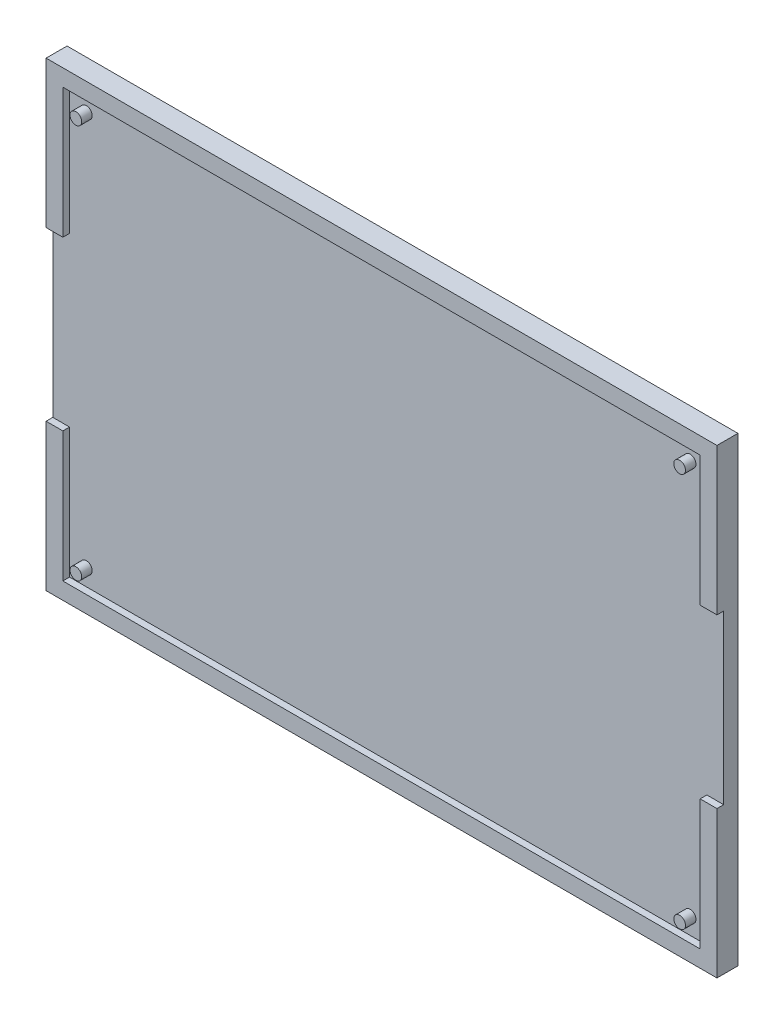
ISO-10303-21;
HEADER;
FILE_DESCRIPTION(('STEP AP214'),'2;1');
FILE_NAME('part.step','',(''),(''),'','','');
FILE_SCHEMA(('AUTOMOTIVE_DESIGN { 1 0 10303 214 1 1 1 1 }'));
ENDSEC;
DATA;
#1=APPLICATION_CONTEXT('core data for automotive mechanical design processes');
#2=APPLICATION_PROTOCOL_DEFINITION('international standard','automotive_design',2000,#1);
#3=PRODUCT_CONTEXT('',#1,'mechanical');
#4=PRODUCT('Part','Part','',(#3));
#5=PRODUCT_RELATED_PRODUCT_CATEGORY('part','',(#4));
#6=PRODUCT_DEFINITION_FORMATION('','',#4);
#7=PRODUCT_DEFINITION_CONTEXT('part definition',#1,'design');
#8=PRODUCT_DEFINITION('design','',#6,#7);
#9=PRODUCT_DEFINITION_SHAPE('','',#8);
#10=(LENGTH_UNIT() NAMED_UNIT(*) SI_UNIT(.MILLI.,.METRE.));
#11=(NAMED_UNIT(*) PLANE_ANGLE_UNIT() SI_UNIT($,.RADIAN.));
#12=(NAMED_UNIT(*) SI_UNIT($,.STERADIAN.) SOLID_ANGLE_UNIT());
#13=UNCERTAINTY_MEASURE_WITH_UNIT(LENGTH_MEASURE(1.E-05),#10,'distance_accuracy_value','');
#14=(GEOMETRIC_REPRESENTATION_CONTEXT(3) GLOBAL_UNCERTAINTY_ASSIGNED_CONTEXT((#13)) GLOBAL_UNIT_ASSIGNED_CONTEXT((#10,
#11,#12)) REPRESENTATION_CONTEXT('',''));
#15=CARTESIAN_POINT('',(0.,0.,0.));
#16=DIRECTION('',(0.,0.,1.));
#17=DIRECTION('',(1.,0.,0.));
#18=AXIS2_PLACEMENT_3D('',#15,#16,#17);
#19=CARTESIAN_POINT('',(0.,0.,5.));
#20=DIRECTION('',(0.,0.,1.));
#21=DIRECTION('',(1.,0.,0.));
#22=AXIS2_PLACEMENT_3D('',#19,#20,#21);
#23=PLANE('',#22);
#24=DIRECTION('',(-1.,0.,0.));
#25=VECTOR('',#24,1.);
#26=CARTESIAN_POINT('',(156.,-35.,5.));
#27=LINE('',#26,#25);
#28=CARTESIAN_POINT('',(160.,-35.,5.));
#29=VERTEX_POINT('',#28);
#30=CARTESIAN_POINT('',(156.,-35.,5.));
#31=VERTEX_POINT('',#30);
#32=EDGE_CURVE('E159',#29,#31,#27,.T.);
#33=ORIENTED_EDGE('',*,*,#32,.F.);
#34=DIRECTION('',(0.,-1.,0.));
#35=VECTOR('',#34,1.);
#36=CARTESIAN_POINT('',(160.,0.,5.));
#37=LINE('',#36,#35);
#38=CARTESIAN_POINT('',(160.,0.,5.));
#39=VERTEX_POINT('',#38);
#40=EDGE_CURVE('E218',#39,#29,#37,.T.);
#41=ORIENTED_EDGE('',*,*,#40,.F.);
#42=DIRECTION('',(1.,0.,0.));
#43=VECTOR('',#42,1.);
#44=CARTESIAN_POINT('',(0.,0.,5.));
#45=LINE('',#44,#43);
#46=CARTESIAN_POINT('',(0.,0.,5.));
#47=VERTEX_POINT('',#46);
#48=EDGE_CURVE('E213',#47,#39,#45,.T.);
#49=ORIENTED_EDGE('',*,*,#48,.F.);
#50=DIRECTION('',(0.,1.,0.));
#51=VECTOR('',#50,1.);
#52=CARTESIAN_POINT('',(0.,0.,5.));
#53=LINE('',#52,#51);
#54=CARTESIAN_POINT('',(0.,-35.,5.));
#55=VERTEX_POINT('',#54);
#56=EDGE_CURVE('E214',#55,#47,#53,.T.);
#57=ORIENTED_EDGE('',*,*,#56,.F.);
#58=DIRECTION('',(-1.,0.,0.));
#59=VECTOR('',#58,1.);
#60=CARTESIAN_POINT('',(3.99999999999999,-35.,5.));
#61=LINE('',#60,#59);
#62=CARTESIAN_POINT('',(3.99999999999999,-35.,5.));
#63=VERTEX_POINT('',#62);
#64=EDGE_CURVE('E263',#63,#55,#61,.T.);
#65=ORIENTED_EDGE('',*,*,#64,.F.);
#66=DIRECTION('',(0.,-1.,0.));
#67=VECTOR('',#66,1.);
#68=CARTESIAN_POINT('',(4.,-106.,4.99999999999999));
#69=LINE('',#68,#67);
#70=CARTESIAN_POINT('',(3.99999999999999,-4.,5.));
#71=VERTEX_POINT('',#70);
#72=EDGE_CURVE('E195',#71,#63,#69,.T.);
#73=ORIENTED_EDGE('',*,*,#72,.F.);
#74=DIRECTION('',(-1.,0.,0.));
#75=VECTOR('',#74,1.);
#76=CARTESIAN_POINT('',(156.,-4.,5.));
#77=LINE('',#76,#75);
#78=CARTESIAN_POINT('',(156.,-4.,5.));
#79=VERTEX_POINT('',#78);
#80=EDGE_CURVE('E190',#79,#71,#77,.T.);
#81=ORIENTED_EDGE('',*,*,#80,.F.);
#82=DIRECTION('',(0.,1.,0.));
#83=VECTOR('',#82,1.);
#84=CARTESIAN_POINT('',(156.,-106.,4.99999999999999));
#85=LINE('',#84,#83);
#86=EDGE_CURVE('E191',#31,#79,#85,.T.);
#87=ORIENTED_EDGE('',*,*,#86,.F.);
#88=EDGE_LOOP('',(#33,#41,#49,#57,#65,#73,#81,#87));
#89=FACE_BOUND('',#88,.T.);
#90=ADVANCED_FACE('F33',(#89),#23,.T.);
#91=CARTESIAN_POINT('',(156.,-106.,3.39999999999999));
#92=DIRECTION('',(1.,0.,0.));
#93=DIRECTION('',(0.,1.,0.));
#94=AXIS2_PLACEMENT_3D('',#91,#92,#93);
#95=PLANE('',#94);
#96=DIRECTION('',(0.,1.,0.));
#97=VECTOR('',#96,1.);
#98=CARTESIAN_POINT('',(156.,-106.,3.39999999999999));
#99=LINE('',#98,#97);
#100=CARTESIAN_POINT('',(156.,-35.,3.4));
#101=VERTEX_POINT('',#100);
#102=CARTESIAN_POINT('',(156.,-4.,3.4));
#103=VERTEX_POINT('',#102);
#104=EDGE_CURVE('E174',#101,#103,#99,.T.);
#105=ORIENTED_EDGE('',*,*,#104,.F.);
#106=DIRECTION('',(0.,0.,1.));
#107=VECTOR('',#106,1.);
#108=CARTESIAN_POINT('',(156.,-35.,3.4));
#109=LINE('',#108,#107);
#110=EDGE_CURVE('E58',#101,#31,#109,.T.);
#111=ORIENTED_EDGE('',*,*,#110,.T.);
#112=ORIENTED_EDGE('',*,*,#86,.T.);
#113=DIRECTION('',(0.,0.,1.));
#114=VECTOR('',#113,1.);
#115=CARTESIAN_POINT('',(156.,-4.,3.4));
#116=LINE('',#115,#114);
#117=EDGE_CURVE('E188',#103,#79,#116,.T.);
#118=ORIENTED_EDGE('',*,*,#117,.F.);
#119=EDGE_LOOP('',(#105,#111,#112,#118));
#120=FACE_BOUND('',#119,.T.);
#121=ADVANCED_FACE('F330',(#120),#95,.F.);
#122=CARTESIAN_POINT('',(4.,-106.,3.39999999999999));
#123=DIRECTION('',(-1.,0.,0.));
#124=DIRECTION('',(0.,-1.,0.));
#125=AXIS2_PLACEMENT_3D('',#122,#123,#124);
#126=PLANE('',#125);
#127=DIRECTION('',(0.,-1.,0.));
#128=VECTOR('',#127,1.);
#129=CARTESIAN_POINT('',(4.,-106.,3.39999999999999));
#130=LINE('',#129,#128);
#131=CARTESIAN_POINT('',(4.,-75.,3.4));
#132=VERTEX_POINT('',#131);
#133=CARTESIAN_POINT('',(4.,-106.,3.39999999999999));
#134=VERTEX_POINT('',#133);
#135=EDGE_CURVE('E177',#132,#134,#130,.T.);
#136=ORIENTED_EDGE('',*,*,#135,.F.);
#137=DIRECTION('',(0.,0.,1.));
#138=VECTOR('',#137,1.);
#139=CARTESIAN_POINT('',(3.99999999999999,-75.,3.4));
#140=LINE('',#139,#138);
#141=CARTESIAN_POINT('',(3.99999999999999,-75.,5.));
#142=VERTEX_POINT('',#141);
#143=EDGE_CURVE('E50',#132,#142,#140,.T.);
#144=ORIENTED_EDGE('',*,*,#143,.T.);
#145=CARTESIAN_POINT('',(4.,-106.,4.99999999999999));
#146=VERTEX_POINT('',#145);
#147=EDGE_CURVE('E194',#142,#146,#69,.T.);
#148=ORIENTED_EDGE('',*,*,#147,.T.);
#149=DIRECTION('',(0.,0.,1.));
#150=VECTOR('',#149,1.);
#151=CARTESIAN_POINT('',(4.,-106.,3.39999999999999));
#152=LINE('',#151,#150);
#153=EDGE_CURVE('E203',#134,#146,#152,.T.);
#154=ORIENTED_EDGE('',*,*,#153,.F.);
#155=EDGE_LOOP('',(#136,#144,#148,#154));
#156=FACE_BOUND('',#155,.T.);
#157=ADVANCED_FACE('F336',(#156),#126,.F.);
#158=CARTESIAN_POINT('',(0.,0.,5.));
#159=DIRECTION('',(-1.,0.,0.));
#160=DIRECTION('',(0.,-1.,0.));
#161=AXIS2_PLACEMENT_3D('',#158,#159,#160);
#162=PLANE('',#161);
#163=DIRECTION('',(0.,0.,1.));
#164=VECTOR('',#163,1.);
#165=CARTESIAN_POINT('',(0.,-75.,5.));
#166=LINE('',#165,#164);
#167=CARTESIAN_POINT('',(0.,-75.,3.4));
#168=VERTEX_POINT('',#167);
#169=CARTESIAN_POINT('',(0.,-75.,5.));
#170=VERTEX_POINT('',#169);
#171=EDGE_CURVE('E279',#168,#170,#166,.T.);
#172=ORIENTED_EDGE('',*,*,#171,.F.);
#173=DIRECTION('',(0.,-1.,0.));
#174=VECTOR('',#173,1.);
#175=CARTESIAN_POINT('',(0.,0.,3.4));
#176=LINE('',#175,#174);
#177=CARTESIAN_POINT('',(0.,-35.,3.4));
#178=VERTEX_POINT('',#177);
#179=EDGE_CURVE('E275',#178,#168,#176,.T.);
#180=ORIENTED_EDGE('',*,*,#179,.F.);
#181=DIRECTION('',(0.,0.,-1.));
#182=VECTOR('',#181,1.);
#183=CARTESIAN_POINT('',(0.,-35.,5.));
#184=LINE('',#183,#182);
#185=EDGE_CURVE('E277',#55,#178,#184,.T.);
#186=ORIENTED_EDGE('',*,*,#185,.F.);
#187=ORIENTED_EDGE('',*,*,#56,.T.);
#188=DIRECTION('',(0.,0.,-1.));
#189=VECTOR('',#188,1.);
#190=CARTESIAN_POINT('',(0.,0.,5.));
#191=LINE('',#190,#189);
#192=CARTESIAN_POINT('',(0.,0.,0.));
#193=VERTEX_POINT('',#192);
#194=EDGE_CURVE('E37',#47,#193,#191,.T.);
#195=ORIENTED_EDGE('',*,*,#194,.T.);
#196=DIRECTION('',(0.,1.,0.));
#197=VECTOR('',#196,1.);
#198=CARTESIAN_POINT('',(0.,0.,0.));
#199=LINE('',#198,#197);
#200=CARTESIAN_POINT('',(0.,-110.,0.));
#201=VERTEX_POINT('',#200);
#202=EDGE_CURVE('E202',#201,#193,#199,.T.);
#203=ORIENTED_EDGE('',*,*,#202,.F.);
#204=DIRECTION('',(0.,0.,-1.));
#205=VECTOR('',#204,1.);
#206=CARTESIAN_POINT('',(0.,-110.,5.));
#207=LINE('',#206,#205);
#208=CARTESIAN_POINT('',(0.,-110.,5.));
#209=VERTEX_POINT('',#208);
#210=EDGE_CURVE('E11',#209,#201,#207,.T.);
#211=ORIENTED_EDGE('',*,*,#210,.F.);
#212=EDGE_CURVE('E210',#209,#170,#53,.T.);
#213=ORIENTED_EDGE('',*,*,#212,.T.);
#214=EDGE_LOOP('',(#172,#180,#186,#187,#195,#203,#211,#213));
#215=FACE_BOUND('',#214,.T.);
#216=ADVANCED_FACE('F35',(#215),#162,.T.);
#217=CARTESIAN_POINT('',(0.,-110.,5.));
#218=DIRECTION('',(0.,-1.,0.));
#219=DIRECTION('',(0.,0.,-1.));
#220=AXIS2_PLACEMENT_3D('',#217,#218,#219);
#221=PLANE('',#220);
#222=DIRECTION('',(-1.,0.,0.));
#223=VECTOR('',#222,1.);
#224=CARTESIAN_POINT('',(0.,-110.,0.));
#225=LINE('',#224,#223);
#226=CARTESIAN_POINT('',(160.,-110.,0.));
#227=VERTEX_POINT('',#226);
#228=EDGE_CURVE('E232',#227,#201,#225,.T.);
#229=ORIENTED_EDGE('',*,*,#228,.F.);
#230=DIRECTION('',(0.,0.,-1.));
#231=VECTOR('',#230,1.);
#232=CARTESIAN_POINT('',(160.,-110.,5.));
#233=LINE('',#232,#231);
#234=CARTESIAN_POINT('',(160.,-110.,5.));
#235=VERTEX_POINT('',#234);
#236=EDGE_CURVE('E42',#235,#227,#233,.T.);
#237=ORIENTED_EDGE('',*,*,#236,.F.);
#238=DIRECTION('',(-1.,0.,0.));
#239=VECTOR('',#238,1.);
#240=CARTESIAN_POINT('',(0.,-110.,5.));
#241=LINE('',#240,#239);
#242=EDGE_CURVE('E221',#235,#209,#241,.T.);
#243=ORIENTED_EDGE('',*,*,#242,.T.);
#244=ORIENTED_EDGE('',*,*,#210,.T.);
#245=EDGE_LOOP('',(#229,#237,#243,#244));
#246=FACE_BOUND('',#245,.T.);
#247=ADVANCED_FACE('F252',(#246),#221,.T.);
#248=CARTESIAN_POINT('',(160.,0.,5.));
#249=DIRECTION('',(1.,0.,0.));
#250=DIRECTION('',(0.,1.,0.));
#251=AXIS2_PLACEMENT_3D('',#248,#249,#250);
#252=PLANE('',#251);
#253=DIRECTION('',(0.,0.,1.));
#254=VECTOR('',#253,1.);
#255=CARTESIAN_POINT('',(160.,-35.,5.));
#256=LINE('',#255,#254);
#257=CARTESIAN_POINT('',(160.,-35.,3.4));
#258=VERTEX_POINT('',#257);
#259=EDGE_CURVE('E284',#258,#29,#256,.T.);
#260=ORIENTED_EDGE('',*,*,#259,.F.);
#261=DIRECTION('',(0.,1.,0.));
#262=VECTOR('',#261,1.);
#263=CARTESIAN_POINT('',(160.,0.,3.4));
#264=LINE('',#263,#262);
#265=CARTESIAN_POINT('',(160.,-75.,3.4));
#266=VERTEX_POINT('',#265);
#267=EDGE_CURVE('E281',#266,#258,#264,.T.);
#268=ORIENTED_EDGE('',*,*,#267,.F.);
#269=DIRECTION('',(0.,0.,-1.));
#270=VECTOR('',#269,1.);
#271=CARTESIAN_POINT('',(160.,-75.,5.));
#272=LINE('',#271,#270);
#273=CARTESIAN_POINT('',(160.,-75.,5.));
#274=VERTEX_POINT('',#273);
#275=EDGE_CURVE('E154',#274,#266,#272,.T.);
#276=ORIENTED_EDGE('',*,*,#275,.F.);
#277=EDGE_CURVE('E217',#274,#235,#37,.T.);
#278=ORIENTED_EDGE('',*,*,#277,.T.);
#279=ORIENTED_EDGE('',*,*,#236,.T.);
#280=DIRECTION('',(0.,-1.,0.));
#281=VECTOR('',#280,1.);
#282=CARTESIAN_POINT('',(160.,0.,0.));
#283=LINE('',#282,#281);
#284=CARTESIAN_POINT('',(160.,0.,0.));
#285=VERTEX_POINT('',#284);
#286=EDGE_CURVE('E229',#285,#227,#283,.T.);
#287=ORIENTED_EDGE('',*,*,#286,.F.);
#288=DIRECTION('',(0.,0.,-1.));
#289=VECTOR('',#288,1.);
#290=CARTESIAN_POINT('',(160.,0.,5.));
#291=LINE('',#290,#289);
#292=EDGE_CURVE('E235',#39,#285,#291,.T.);
#293=ORIENTED_EDGE('',*,*,#292,.F.);
#294=ORIENTED_EDGE('',*,*,#40,.T.);
#295=EDGE_LOOP('',(#260,#268,#276,#278,#279,#287,#293,#294));
#296=FACE_BOUND('',#295,.T.);
#297=ADVANCED_FACE('F346',(#296),#252,.T.);
#298=CARTESIAN_POINT('',(0.,0.,5.));
#299=DIRECTION('',(0.,1.,0.));
#300=DIRECTION('',(0.,0.,1.));
#301=AXIS2_PLACEMENT_3D('',#298,#299,#300);
#302=PLANE('',#301);
#303=DIRECTION('',(1.,0.,0.));
#304=VECTOR('',#303,1.);
#305=CARTESIAN_POINT('',(0.,0.,0.));
#306=LINE('',#305,#304);
#307=EDGE_CURVE('E226',#193,#285,#306,.T.);
#308=ORIENTED_EDGE('',*,*,#307,.F.);
#309=ORIENTED_EDGE('',*,*,#194,.F.);
#310=ORIENTED_EDGE('',*,*,#48,.T.);
#311=ORIENTED_EDGE('',*,*,#292,.T.);
#312=EDGE_LOOP('',(#308,#309,#310,#311));
#313=FACE_BOUND('',#312,.T.);
#314=ADVANCED_FACE('F246',(#313),#302,.T.);
#315=DIRECTION('',(1.,0.,0.));
#316=VECTOR('',#315,1.);
#317=CARTESIAN_POINT('',(156.,-75.,5.));
#318=LINE('',#317,#316);
#319=CARTESIAN_POINT('',(156.,-75.,5.));
#320=VERTEX_POINT('',#319);
#321=EDGE_CURVE('E272',#320,#274,#318,.T.);
#322=ORIENTED_EDGE('',*,*,#321,.F.);
#323=CARTESIAN_POINT('',(156.,-106.,4.99999999999999));
#324=VERTEX_POINT('',#323);
#325=EDGE_CURVE('E168',#324,#320,#85,.T.);
#326=ORIENTED_EDGE('',*,*,#325,.F.);
#327=DIRECTION('',(1.,0.,0.));
#328=VECTOR('',#327,1.);
#329=CARTESIAN_POINT('',(156.,-106.,4.99999999999999));
#330=LINE('',#329,#328);
#331=EDGE_CURVE('E179',#146,#324,#330,.T.);
#332=ORIENTED_EDGE('',*,*,#331,.F.);
#333=ORIENTED_EDGE('',*,*,#147,.F.);
#334=DIRECTION('',(1.,0.,0.));
#335=VECTOR('',#334,1.);
#336=CARTESIAN_POINT('',(3.99999999999999,-75.,5.));
#337=LINE('',#336,#335);
#338=EDGE_CURVE('E260',#170,#142,#337,.T.);
#339=ORIENTED_EDGE('',*,*,#338,.F.);
#340=ORIENTED_EDGE('',*,*,#212,.F.);
#341=ORIENTED_EDGE('',*,*,#242,.F.);
#342=ORIENTED_EDGE('',*,*,#277,.F.);
#343=EDGE_LOOP('',(#322,#326,#332,#333,#339,#340,#341,#342));
#344=FACE_BOUND('',#343,.T.);
#345=ADVANCED_FACE('F257',(#344),#23,.T.);
#346=CARTESIAN_POINT('',(0.,0.,0.));
#347=DIRECTION('',(0.,0.,1.));
#348=DIRECTION('',(1.,0.,0.));
#349=AXIS2_PLACEMENT_3D('',#346,#347,#348);
#350=PLANE('',#349);
#351=ORIENTED_EDGE('',*,*,#202,.T.);
#352=ORIENTED_EDGE('',*,*,#307,.T.);
#353=ORIENTED_EDGE('',*,*,#286,.T.);
#354=ORIENTED_EDGE('',*,*,#228,.T.);
#355=EDGE_LOOP('',(#351,#352,#353,#354));
#356=FACE_BOUND('',#355,.T.);
#357=ADVANCED_FACE('F248',(#356),#350,.F.);
#358=ORIENTED_EDGE('',*,*,#325,.T.);
#359=DIRECTION('',(0.,0.,1.));
#360=VECTOR('',#359,1.);
#361=CARTESIAN_POINT('',(156.,-75.,3.4));
#362=LINE('',#361,#360);
#363=CARTESIAN_POINT('',(156.,-75.,3.4));
#364=VERTEX_POINT('',#363);
#365=EDGE_CURVE('E151',#364,#320,#362,.T.);
#366=ORIENTED_EDGE('',*,*,#365,.F.);
#367=CARTESIAN_POINT('',(156.,-106.,3.39999999999999));
#368=VERTEX_POINT('',#367);
#369=EDGE_CURVE('E165',#368,#364,#99,.T.);
#370=ORIENTED_EDGE('',*,*,#369,.F.);
#371=DIRECTION('',(0.,0.,1.));
#372=VECTOR('',#371,1.);
#373=CARTESIAN_POINT('',(156.,-106.,3.39999999999999));
#374=LINE('',#373,#372);
#375=EDGE_CURVE('E200',#368,#324,#374,.T.);
#376=ORIENTED_EDGE('',*,*,#375,.T.);
#377=EDGE_LOOP('',(#358,#366,#370,#376));
#378=FACE_BOUND('',#377,.T.);
#379=ADVANCED_FACE('F164',(#378),#95,.F.);
#380=CARTESIAN_POINT('',(156.,-106.,3.39999999999999));
#381=DIRECTION('',(0.,-1.,0.));
#382=DIRECTION('',(1.,0.,0.));
#383=AXIS2_PLACEMENT_3D('',#380,#381,#382);
#384=PLANE('',#383);
#385=ORIENTED_EDGE('',*,*,#331,.T.);
#386=ORIENTED_EDGE('',*,*,#375,.F.);
#387=DIRECTION('',(1.,0.,0.));
#388=VECTOR('',#387,1.);
#389=CARTESIAN_POINT('',(156.,-106.,3.39999999999999));
#390=LINE('',#389,#388);
#391=EDGE_CURVE('E172',#134,#368,#390,.T.);
#392=ORIENTED_EDGE('',*,*,#391,.F.);
#393=ORIENTED_EDGE('',*,*,#153,.T.);
#394=EDGE_LOOP('',(#385,#386,#392,#393));
#395=FACE_BOUND('',#394,.T.);
#396=ADVANCED_FACE('F366',(#395),#384,.F.);
#397=ORIENTED_EDGE('',*,*,#72,.T.);
#398=DIRECTION('',(0.,0.,1.));
#399=VECTOR('',#398,1.);
#400=CARTESIAN_POINT('',(3.99999999999999,-35.,3.4));
#401=LINE('',#400,#399);
#402=CARTESIAN_POINT('',(3.99999999999999,-35.,3.4));
#403=VERTEX_POINT('',#402);
#404=EDGE_CURVE('E273',#403,#63,#401,.T.);
#405=ORIENTED_EDGE('',*,*,#404,.F.);
#406=CARTESIAN_POINT('',(3.99999999999999,-4.,3.4));
#407=VERTEX_POINT('',#406);
#408=EDGE_CURVE('E184',#407,#403,#130,.T.);
#409=ORIENTED_EDGE('',*,*,#408,.F.);
#410=DIRECTION('',(0.,0.,1.));
#411=VECTOR('',#410,1.);
#412=CARTESIAN_POINT('',(3.99999999999999,-4.,3.4));
#413=LINE('',#412,#411);
#414=EDGE_CURVE('E206',#407,#71,#413,.T.);
#415=ORIENTED_EDGE('',*,*,#414,.T.);
#416=EDGE_LOOP('',(#397,#405,#409,#415));
#417=FACE_BOUND('',#416,.T.);
#418=ADVANCED_FACE('F323',(#417),#126,.F.);
#419=CARTESIAN_POINT('',(156.,-4.,3.4));
#420=DIRECTION('',(0.,1.,0.));
#421=DIRECTION('',(0.,0.,1.));
#422=AXIS2_PLACEMENT_3D('',#419,#420,#421);
#423=PLANE('',#422);
#424=ORIENTED_EDGE('',*,*,#80,.T.);
#425=ORIENTED_EDGE('',*,*,#414,.F.);
#426=DIRECTION('',(-1.,0.,0.));
#427=VECTOR('',#426,1.);
#428=CARTESIAN_POINT('',(156.,-4.,3.4));
#429=LINE('',#428,#427);
#430=EDGE_CURVE('E173',#103,#407,#429,.T.);
#431=ORIENTED_EDGE('',*,*,#430,.F.);
#432=ORIENTED_EDGE('',*,*,#117,.T.);
#433=EDGE_LOOP('',(#424,#425,#431,#432));
#434=FACE_BOUND('',#433,.T.);
#435=ADVANCED_FACE('F313',(#434),#423,.F.);
#436=CARTESIAN_POINT('',(0.,0.,3.4));
#437=DIRECTION('',(0.,0.,1.));
#438=DIRECTION('',(0.,-1.,0.));
#439=AXIS2_PLACEMENT_3D('',#436,#437,#438);
#440=PLANE('',#439);
#441=CARTESIAN_POINT('',(7.99999999999998,-8.,3.4));
#442=DIRECTION('',(0.,0.,1.));
#443=DIRECTION('',(0.,-1.,0.));
#444=AXIS2_PLACEMENT_3D('',#441,#442,#443);
#445=CIRCLE('',#444,1.4);
#446=CARTESIAN_POINT('',(7.99999999999998,-9.4,3.4));
#447=VERTEX_POINT('',#446);
#448=EDGE_CURVE('E286',#447,#447,#445,.T.);
#449=ORIENTED_EDGE('',*,*,#448,.F.);
#450=EDGE_LOOP('',(#449));
#451=FACE_BOUND('',#450,.T.);
#452=CARTESIAN_POINT('',(152.,-8.,3.4));
#453=DIRECTION('',(0.,0.,1.));
#454=DIRECTION('',(0.,-1.,0.));
#455=AXIS2_PLACEMENT_3D('',#452,#453,#454);
#456=CIRCLE('',#455,1.4);
#457=CARTESIAN_POINT('',(152.,-9.4,3.4));
#458=VERTEX_POINT('',#457);
#459=EDGE_CURVE('E290',#458,#458,#456,.T.);
#460=ORIENTED_EDGE('',*,*,#459,.F.);
#461=EDGE_LOOP('',(#460));
#462=FACE_BOUND('',#461,.T.);
#463=CARTESIAN_POINT('',(7.99999999999999,-102.,3.39999999999999));
#464=DIRECTION('',(0.,0.,1.));
#465=DIRECTION('',(0.,-1.,0.));
#466=AXIS2_PLACEMENT_3D('',#463,#464,#465);
#467=CIRCLE('',#466,1.4);
#468=CARTESIAN_POINT('',(7.99999999999999,-103.4,3.39999999999999));
#469=VERTEX_POINT('',#468);
#470=EDGE_CURVE('E296',#469,#469,#467,.T.);
#471=ORIENTED_EDGE('',*,*,#470,.F.);
#472=EDGE_LOOP('',(#471));
#473=FACE_BOUND('',#472,.T.);
#474=CARTESIAN_POINT('',(152.,-102.,3.39999999999999));
#475=DIRECTION('',(0.,0.,1.));
#476=DIRECTION('',(0.,-1.,0.));
#477=AXIS2_PLACEMENT_3D('',#474,#475,#476);
#478=CIRCLE('',#477,1.4);
#479=CARTESIAN_POINT('',(152.,-103.4,3.39999999999999));
#480=VERTEX_POINT('',#479);
#481=EDGE_CURVE('E181',#480,#480,#478,.T.);
#482=ORIENTED_EDGE('',*,*,#481,.F.);
#483=EDGE_LOOP('',(#482));
#484=FACE_BOUND('',#483,.T.);
#485=ORIENTED_EDGE('',*,*,#369,.T.);
#486=DIRECTION('',(1.,0.,0.));
#487=VECTOR('',#486,1.);
#488=CARTESIAN_POINT('',(156.,-75.,3.4));
#489=LINE('',#488,#487);
#490=EDGE_CURVE('E148',#364,#266,#489,.T.);
#491=ORIENTED_EDGE('',*,*,#490,.T.);
#492=ORIENTED_EDGE('',*,*,#267,.T.);
#493=DIRECTION('',(-1.,0.,0.));
#494=VECTOR('',#493,1.);
#495=CARTESIAN_POINT('',(156.,-35.,3.4));
#496=LINE('',#495,#494);
#497=EDGE_CURVE('E158',#258,#101,#496,.T.);
#498=ORIENTED_EDGE('',*,*,#497,.T.);
#499=ORIENTED_EDGE('',*,*,#104,.T.);
#500=ORIENTED_EDGE('',*,*,#430,.T.);
#501=ORIENTED_EDGE('',*,*,#408,.T.);
#502=DIRECTION('',(-1.,0.,0.));
#503=VECTOR('',#502,1.);
#504=CARTESIAN_POINT('',(3.99999999999999,-35.,3.4));
#505=LINE('',#504,#503);
#506=EDGE_CURVE('E262',#403,#178,#505,.T.);
#507=ORIENTED_EDGE('',*,*,#506,.T.);
#508=ORIENTED_EDGE('',*,*,#179,.T.);
#509=DIRECTION('',(1.,0.,0.));
#510=VECTOR('',#509,1.);
#511=CARTESIAN_POINT('',(3.99999999999999,-75.,3.4));
#512=LINE('',#511,#510);
#513=EDGE_CURVE('E266',#168,#132,#512,.T.);
#514=ORIENTED_EDGE('',*,*,#513,.T.);
#515=ORIENTED_EDGE('',*,*,#135,.T.);
#516=ORIENTED_EDGE('',*,*,#391,.T.);
#517=EDGE_LOOP('',(#485,#491,#492,#498,#499,#500,#501,#507,#508,#514,#515,#516));
#518=FACE_BOUND('',#517,.T.);
#519=ADVANCED_FACE('F170',(#451,#462,#473,#484,#518),#440,.T.);
#520=CARTESIAN_POINT('',(152.,-102.,5.89999999999999));
#521=DIRECTION('',(0.,0.,-1.));
#522=DIRECTION('',(0.,1.,0.));
#523=AXIS2_PLACEMENT_3D('',#520,#521,#522);
#524=CYLINDRICAL_SURFACE('',#523,1.4);
#525=CARTESIAN_POINT('',(152.,-102.,5.89999999999999));
#526=DIRECTION('',(0.,0.,1.));
#527=DIRECTION('',(0.,-1.,0.));
#528=AXIS2_PLACEMENT_3D('',#525,#526,#527);
#529=CIRCLE('',#528,1.4);
#530=CARTESIAN_POINT('',(152.,-103.4,5.89999999999999));
#531=VERTEX_POINT('',#530);
#532=EDGE_CURVE('E303',#531,#531,#529,.T.);
#533=ORIENTED_EDGE('',*,*,#532,.F.);
#534=EDGE_LOOP('',(#533));
#535=FACE_BOUND('',#534,.T.);
#536=ORIENTED_EDGE('',*,*,#481,.T.);
#537=EDGE_LOOP('',(#536));
#538=FACE_BOUND('',#537,.T.);
#539=ADVANCED_FACE('F310',(#535,#538),#524,.T.);
#540=CARTESIAN_POINT('',(152.,-102.,5.89999999999999));
#541=DIRECTION('',(0.,0.,1.));
#542=DIRECTION('',(0.,-1.,0.));
#543=AXIS2_PLACEMENT_3D('',#540,#541,#542);
#544=PLANE('',#543);
#545=ORIENTED_EDGE('',*,*,#532,.T.);
#546=EDGE_LOOP('',(#545));
#547=FACE_BOUND('',#546,.T.);
#548=ADVANCED_FACE('F320',(#547),#544,.T.);
#549=CARTESIAN_POINT('',(7.99999999999999,-102.,5.89999999999999));
#550=DIRECTION('',(0.,0.,-1.));
#551=DIRECTION('',(0.,1.,0.));
#552=AXIS2_PLACEMENT_3D('',#549,#550,#551);
#553=CYLINDRICAL_SURFACE('',#552,1.4);
#554=CARTESIAN_POINT('',(7.99999999999999,-102.,5.89999999999999));
#555=DIRECTION('',(0.,0.,1.));
#556=DIRECTION('',(0.,-1.,0.));
#557=AXIS2_PLACEMENT_3D('',#554,#555,#556);
#558=CIRCLE('',#557,1.4);
#559=CARTESIAN_POINT('',(7.99999999999999,-103.4,5.89999999999999));
#560=VERTEX_POINT('',#559);
#561=EDGE_CURVE('E299',#560,#560,#558,.T.);
#562=ORIENTED_EDGE('',*,*,#561,.F.);
#563=EDGE_LOOP('',(#562));
#564=FACE_BOUND('',#563,.T.);
#565=ORIENTED_EDGE('',*,*,#470,.T.);
#566=EDGE_LOOP('',(#565));
#567=FACE_BOUND('',#566,.T.);
#568=ADVANCED_FACE('F423',(#564,#567),#553,.T.);
#569=CARTESIAN_POINT('',(7.99999999999999,-102.,5.89999999999999));
#570=DIRECTION('',(0.,0.,1.));
#571=DIRECTION('',(0.,-1.,0.));
#572=AXIS2_PLACEMENT_3D('',#569,#570,#571);
#573=PLANE('',#572);
#574=ORIENTED_EDGE('',*,*,#561,.T.);
#575=EDGE_LOOP('',(#574));
#576=FACE_BOUND('',#575,.T.);
#577=ADVANCED_FACE('F419',(#576),#573,.T.);
#578=CARTESIAN_POINT('',(152.,-8.,5.9));
#579=DIRECTION('',(0.,0.,-1.));
#580=DIRECTION('',(0.,1.,0.));
#581=AXIS2_PLACEMENT_3D('',#578,#579,#580);
#582=CYLINDRICAL_SURFACE('',#581,1.4);
#583=CARTESIAN_POINT('',(152.,-8.,5.9));
#584=DIRECTION('',(0.,0.,1.));
#585=DIRECTION('',(0.,-1.,0.));
#586=AXIS2_PLACEMENT_3D('',#583,#584,#585);
#587=CIRCLE('',#586,1.4);
#588=CARTESIAN_POINT('',(152.,-9.4,5.9));
#589=VERTEX_POINT('',#588);
#590=EDGE_CURVE('E293',#589,#589,#587,.T.);
#591=ORIENTED_EDGE('',*,*,#590,.F.);
#592=EDGE_LOOP('',(#591));
#593=FACE_BOUND('',#592,.T.);
#594=ORIENTED_EDGE('',*,*,#459,.T.);
#595=EDGE_LOOP('',(#594));
#596=FACE_BOUND('',#595,.T.);
#597=ADVANCED_FACE('F415',(#593,#596),#582,.T.);
#598=CARTESIAN_POINT('',(152.,-8.,5.9));
#599=DIRECTION('',(0.,0.,1.));
#600=DIRECTION('',(0.,-1.,0.));
#601=AXIS2_PLACEMENT_3D('',#598,#599,#600);
#602=PLANE('',#601);
#603=ORIENTED_EDGE('',*,*,#590,.T.);
#604=EDGE_LOOP('',(#603));
#605=FACE_BOUND('',#604,.T.);
#606=ADVANCED_FACE('F411',(#605),#602,.T.);
#607=CARTESIAN_POINT('',(7.99999999999998,-8.,5.9));
#608=DIRECTION('',(0.,0.,-1.));
#609=DIRECTION('',(0.,1.,0.));
#610=AXIS2_PLACEMENT_3D('',#607,#608,#609);
#611=CYLINDRICAL_SURFACE('',#610,1.4);
#612=CARTESIAN_POINT('',(7.99999999999998,-8.,5.9));
#613=DIRECTION('',(0.,0.,1.));
#614=DIRECTION('',(0.,-1.,0.));
#615=AXIS2_PLACEMENT_3D('',#612,#613,#614);
#616=CIRCLE('',#615,1.4);
#617=CARTESIAN_POINT('',(7.99999999999998,-9.4,5.9));
#618=VERTEX_POINT('',#617);
#619=EDGE_CURVE('E287',#618,#618,#616,.T.);
#620=ORIENTED_EDGE('',*,*,#619,.F.);
#621=EDGE_LOOP('',(#620));
#622=FACE_BOUND('',#621,.T.);
#623=ORIENTED_EDGE('',*,*,#448,.T.);
#624=EDGE_LOOP('',(#623));
#625=FACE_BOUND('',#624,.T.);
#626=ADVANCED_FACE('F407',(#622,#625),#611,.T.);
#627=CARTESIAN_POINT('',(7.99999999999998,-8.,5.9));
#628=DIRECTION('',(0.,0.,1.));
#629=DIRECTION('',(0.,-1.,0.));
#630=AXIS2_PLACEMENT_3D('',#627,#628,#629);
#631=PLANE('',#630);
#632=ORIENTED_EDGE('',*,*,#619,.T.);
#633=EDGE_LOOP('',(#632));
#634=FACE_BOUND('',#633,.T.);
#635=ADVANCED_FACE('F403',(#634),#631,.T.);
#636=CARTESIAN_POINT('',(3.99999999999999,-75.,3.4));
#637=DIRECTION('',(0.,-1.,0.));
#638=DIRECTION('',(0.,0.,-1.));
#639=AXIS2_PLACEMENT_3D('',#636,#637,#638);
#640=PLANE('',#639);
#641=ORIENTED_EDGE('',*,*,#171,.T.);
#642=ORIENTED_EDGE('',*,*,#338,.T.);
#643=ORIENTED_EDGE('',*,*,#143,.F.);
#644=ORIENTED_EDGE('',*,*,#513,.F.);
#645=EDGE_LOOP('',(#641,#642,#643,#644));
#646=FACE_BOUND('',#645,.T.);
#647=ADVANCED_FACE('F381',(#646),#640,.F.);
#648=CARTESIAN_POINT('',(3.99999999999999,-35.,3.4));
#649=DIRECTION('',(0.,1.,0.));
#650=DIRECTION('',(0.,0.,1.));
#651=AXIS2_PLACEMENT_3D('',#648,#649,#650);
#652=PLANE('',#651);
#653=ORIENTED_EDGE('',*,*,#185,.T.);
#654=ORIENTED_EDGE('',*,*,#506,.F.);
#655=ORIENTED_EDGE('',*,*,#404,.T.);
#656=ORIENTED_EDGE('',*,*,#64,.T.);
#657=EDGE_LOOP('',(#653,#654,#655,#656));
#658=FACE_BOUND('',#657,.T.);
#659=ADVANCED_FACE('F379',(#658),#652,.F.);
#660=CARTESIAN_POINT('',(156.,-35.,3.4));
#661=DIRECTION('',(0.,1.,0.));
#662=DIRECTION('',(-1.,0.,0.));
#663=AXIS2_PLACEMENT_3D('',#660,#661,#662);
#664=PLANE('',#663);
#665=ORIENTED_EDGE('',*,*,#259,.T.);
#666=ORIENTED_EDGE('',*,*,#32,.T.);
#667=ORIENTED_EDGE('',*,*,#110,.F.);
#668=ORIENTED_EDGE('',*,*,#497,.F.);
#669=EDGE_LOOP('',(#665,#666,#667,#668));
#670=FACE_BOUND('',#669,.T.);
#671=ADVANCED_FACE('F392',(#670),#664,.F.);
#672=CARTESIAN_POINT('',(156.,-75.,3.4));
#673=DIRECTION('',(0.,-1.,0.));
#674=DIRECTION('',(0.,0.,-1.));
#675=AXIS2_PLACEMENT_3D('',#672,#673,#674);
#676=PLANE('',#675);
#677=ORIENTED_EDGE('',*,*,#275,.T.);
#678=ORIENTED_EDGE('',*,*,#490,.F.);
#679=ORIENTED_EDGE('',*,*,#365,.T.);
#680=ORIENTED_EDGE('',*,*,#321,.T.);
#681=EDGE_LOOP('',(#677,#678,#679,#680));
#682=FACE_BOUND('',#681,.T.);
#683=ADVANCED_FACE('F150',(#682),#676,.F.);
#684=CLOSED_SHELL('',(#90,#121,#157,#216,#247,#297,#314,#345,#357,#379,#396,#418,#435,#519,#539,
#548,#568,#577,#597,#606,#626,#635,#647,#659,#671,#683));
#685=MANIFOLD_SOLID_BREP('B2',#684);
#686=ADVANCED_BREP_SHAPE_REPRESENTATION('',(#18,#685),#14);
#687=SHAPE_DEFINITION_REPRESENTATION(#9,#686);
ENDSEC;
END-ISO-10303-21;
